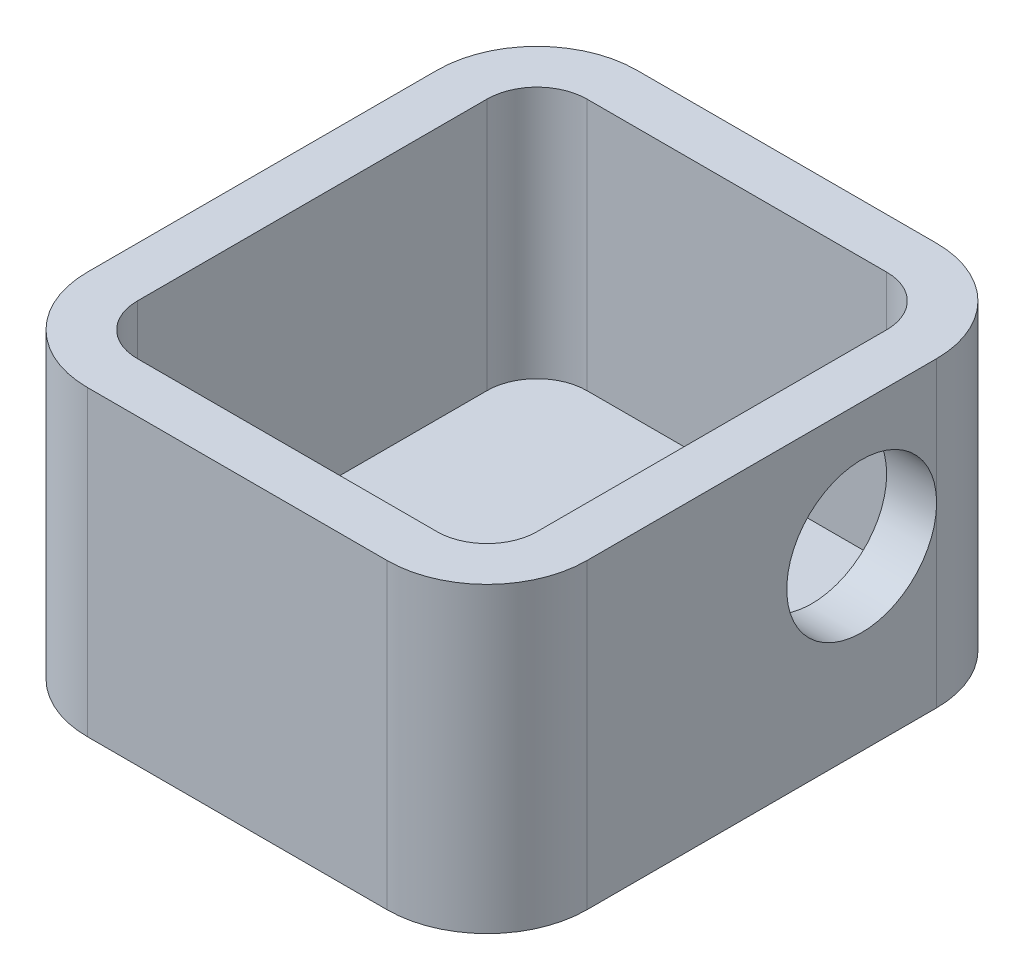
ISO-10303-21;
HEADER;
FILE_DESCRIPTION(('STEP AP214'),'2;1');
FILE_NAME('part.step','',(''),(''),'','','');
FILE_SCHEMA(('AUTOMOTIVE_DESIGN { 1 0 10303 214 1 1 1 1 }'));
ENDSEC;
DATA;
#1=APPLICATION_CONTEXT('core data for automotive mechanical design processes');
#2=APPLICATION_PROTOCOL_DEFINITION('international standard','automotive_design',2000,#1);
#3=PRODUCT_CONTEXT('',#1,'mechanical');
#4=PRODUCT('Part','Part','',(#3));
#5=PRODUCT_RELATED_PRODUCT_CATEGORY('part','',(#4));
#6=PRODUCT_DEFINITION_FORMATION('','',#4);
#7=PRODUCT_DEFINITION_CONTEXT('part definition',#1,'design');
#8=PRODUCT_DEFINITION('design','',#6,#7);
#9=PRODUCT_DEFINITION_SHAPE('','',#8);
#10=(LENGTH_UNIT() NAMED_UNIT(*) SI_UNIT(.MILLI.,.METRE.));
#11=(NAMED_UNIT(*) PLANE_ANGLE_UNIT() SI_UNIT($,.RADIAN.));
#12=(NAMED_UNIT(*) SI_UNIT($,.STERADIAN.) SOLID_ANGLE_UNIT());
#13=UNCERTAINTY_MEASURE_WITH_UNIT(LENGTH_MEASURE(1.E-05),#10,'distance_accuracy_value','');
#14=(GEOMETRIC_REPRESENTATION_CONTEXT(3) GLOBAL_UNCERTAINTY_ASSIGNED_CONTEXT((#13)) GLOBAL_UNIT_ASSIGNED_CONTEXT((#10,
#11,#12)) REPRESENTATION_CONTEXT('',''));
#15=CARTESIAN_POINT('',(0.,0.,0.));
#16=DIRECTION('',(0.,0.,1.));
#17=DIRECTION('',(1.,0.,0.));
#18=AXIS2_PLACEMENT_3D('',#15,#16,#17);
#19=CARTESIAN_POINT('',(-3.8307918132341,34.1865726109847,0.));
#20=DIRECTION('',(1.,0.,0.));
#21=DIRECTION('',(0.,0.,-1.));
#22=AXIS2_PLACEMENT_3D('',#19,#20,#21);
#23=PLANE('',#22);
#24=DIRECTION('',(0.,-1.,0.));
#25=VECTOR('',#24,1.);
#26=CARTESIAN_POINT('',(-3.8307918132341,34.1865726109847,-12.996740625783));
#27=LINE('',#26,#25);
#28=CARTESIAN_POINT('',(-3.8307918132341,-0.545564883652351,-12.996740625783));
#29=VERTEX_POINT('',#28);
#30=CARTESIAN_POINT('',(-3.8307918132341,-7.65556488365235,-12.996740625783));
#31=VERTEX_POINT('',#30);
#32=EDGE_CURVE('E270',#29,#31,#27,.T.);
#33=ORIENTED_EDGE('',*,*,#32,.F.);
#34=CARTESIAN_POINT('',(-3.8307918132341,-0.545564883652351,-9.99674062578299));
#35=DIRECTION('',(-1.,0.,0.));
#36=DIRECTION('',(0.,0.,1.));
#37=AXIS2_PLACEMENT_3D('',#34,#35,#36);
#38=CIRCLE('',#37,3.);
#39=EDGE_CURVE('E74',#29,#29,#38,.T.);
#40=ORIENTED_EDGE('',*,*,#39,.T.);
#41=CARTESIAN_POINT('',(-3.8307918132341,4.45443511634765,-12.996740625783));
#42=VERTEX_POINT('',#41);
#43=EDGE_CURVE('E266',#42,#29,#27,.T.);
#44=ORIENTED_EDGE('',*,*,#43,.F.);
#45=DIRECTION('',(0.,0.,-1.));
#46=VECTOR('',#45,1.);
#47=CARTESIAN_POINT('',(-3.8307918132341,4.45443511634765,0.));
#48=LINE('',#47,#46);
#49=CARTESIAN_POINT('',(-3.8307918132341,4.45443511634765,1.00325937421701));
#50=VERTEX_POINT('',#49);
#51=EDGE_CURVE('E278',#50,#42,#48,.T.);
#52=ORIENTED_EDGE('',*,*,#51,.F.);
#53=DIRECTION('',(0.,-1.,0.));
#54=VECTOR('',#53,1.);
#55=CARTESIAN_POINT('',(-3.8307918132341,34.1865726109847,1.00325937421701));
#56=LINE('',#55,#54);
#57=CARTESIAN_POINT('',(-3.8307918132341,-7.65556488365235,1.00325937421701));
#58=VERTEX_POINT('',#57);
#59=EDGE_CURVE('E225',#50,#58,#56,.T.);
#60=ORIENTED_EDGE('',*,*,#59,.T.);
#61=DIRECTION('',(0.,0.,1.));
#62=VECTOR('',#61,1.);
#63=CARTESIAN_POINT('',(-3.8307918132341,-7.65556488365235,-12.996740625783));
#64=LINE('',#63,#62);
#65=EDGE_CURVE('E216',#31,#58,#64,.T.);
#66=ORIENTED_EDGE('',*,*,#65,.F.);
#67=EDGE_LOOP('',(#33,#40,#44,#52,#60,#66));
#68=FACE_BOUND('',#67,.T.);
#69=ADVANCED_FACE('F60',(#68),#23,.T.);
#70=CARTESIAN_POINT('',(-5.8307918132341,34.1865726109847,0.));
#71=DIRECTION('',(1.,0.,0.));
#72=DIRECTION('',(0.,0.,-1.));
#73=AXIS2_PLACEMENT_3D('',#70,#71,#72);
#74=PLANE('',#73);
#75=DIRECTION('',(0.,-1.,0.));
#76=VECTOR('',#75,1.);
#77=CARTESIAN_POINT('',(-5.8307918132341,34.1865726109847,-12.996740625783));
#78=LINE('',#77,#76);
#79=CARTESIAN_POINT('',(-5.8307918132341,4.45443511634765,-12.996740625783));
#80=VERTEX_POINT('',#79);
#81=CARTESIAN_POINT('',(-5.8307918132341,-0.545564883652351,-12.996740625783));
#82=VERTEX_POINT('',#81);
#83=EDGE_CURVE('E240',#80,#82,#78,.T.);
#84=ORIENTED_EDGE('',*,*,#83,.T.);
#85=CARTESIAN_POINT('',(-5.8307918132341,-0.545564883652351,-9.99674062578299));
#86=DIRECTION('',(1.,0.,0.));
#87=DIRECTION('',(0.,0.,-1.));
#88=AXIS2_PLACEMENT_3D('',#85,#86,#87);
#89=CIRCLE('',#88,3.);
#90=EDGE_CURVE('E79',#82,#82,#89,.T.);
#91=ORIENTED_EDGE('',*,*,#90,.T.);
#92=CARTESIAN_POINT('',(-5.8307918132341,-5.65556488365235,-12.996740625783));
#93=VERTEX_POINT('',#92);
#94=EDGE_CURVE('E286',#82,#93,#78,.T.);
#95=ORIENTED_EDGE('',*,*,#94,.T.);
#96=DIRECTION('',(0.,0.,1.));
#97=VECTOR('',#96,1.);
#98=CARTESIAN_POINT('',(-5.8307918132341,-5.65556488365235,0.));
#99=LINE('',#98,#97);
#100=CARTESIAN_POINT('',(-5.8307918132341,-5.65556488365235,1.00325937421701));
#101=VERTEX_POINT('',#100);
#102=EDGE_CURVE('E236',#93,#101,#99,.T.);
#103=ORIENTED_EDGE('',*,*,#102,.T.);
#104=DIRECTION('',(0.,-1.,0.));
#105=VECTOR('',#104,1.);
#106=CARTESIAN_POINT('',(-5.8307918132341,34.1865726109847,1.00325937421701));
#107=LINE('',#106,#105);
#108=CARTESIAN_POINT('',(-5.8307918132341,4.45443511634765,1.00325937421701));
#109=VERTEX_POINT('',#108);
#110=EDGE_CURVE('E245',#109,#101,#107,.T.);
#111=ORIENTED_EDGE('',*,*,#110,.F.);
#112=DIRECTION('',(0.,0.,-1.));
#113=VECTOR('',#112,1.);
#114=CARTESIAN_POINT('',(-5.8307918132341,4.45443511634765,0.));
#115=LINE('',#114,#113);
#116=EDGE_CURVE('E234',#109,#80,#115,.T.);
#117=ORIENTED_EDGE('',*,*,#116,.T.);
#118=EDGE_LOOP('',(#84,#91,#95,#103,#111,#117));
#119=FACE_BOUND('',#118,.T.);
#120=ADVANCED_FACE('F367',(#119),#74,.F.);
#121=CARTESIAN_POINT('',(-7.8307918132341,34.1865726109847,-12.996740625783));
#122=DIRECTION('',(0.,-1.,0.));
#123=DIRECTION('',(0.,0.,-1.));
#124=AXIS2_PLACEMENT_3D('',#121,#122,#123);
#125=CYLINDRICAL_SURFACE('',#124,4.);
#126=CARTESIAN_POINT('',(-7.8307918132341,4.45443511634765,-12.996740625783));
#127=DIRECTION('',(0.,-1.,0.));
#128=DIRECTION('',(0.,0.,-1.));
#129=AXIS2_PLACEMENT_3D('',#126,#127,#128);
#130=CIRCLE('',#129,4.);
#131=CARTESIAN_POINT('',(-7.8307918132341,4.45443511634765,-16.996740625783));
#132=VERTEX_POINT('',#131);
#133=EDGE_CURVE('E314',#42,#132,#130,.F.);
#134=ORIENTED_EDGE('',*,*,#133,.F.);
#135=ORIENTED_EDGE('',*,*,#43,.T.);
#136=ORIENTED_EDGE('',*,*,#32,.T.);
#137=CARTESIAN_POINT('',(-7.8307918132341,-7.65556488365235,-12.996740625783));
#138=DIRECTION('',(0.,-1.,0.));
#139=DIRECTION('',(0.,0.,-1.));
#140=AXIS2_PLACEMENT_3D('',#137,#138,#139);
#141=CIRCLE('',#140,4.);
#142=CARTESIAN_POINT('',(-7.8307918132341,-7.65556488365235,-16.996740625783));
#143=VERTEX_POINT('',#142);
#144=EDGE_CURVE('E213',#143,#31,#141,.T.);
#145=ORIENTED_EDGE('',*,*,#144,.F.);
#146=DIRECTION('',(0.,-1.,0.));
#147=VECTOR('',#146,1.);
#148=CARTESIAN_POINT('',(-7.8307918132341,34.1865726109847,-16.996740625783));
#149=LINE('',#148,#147);
#150=EDGE_CURVE('E269',#132,#143,#149,.T.);
#151=ORIENTED_EDGE('',*,*,#150,.F.);
#152=EDGE_LOOP('',(#134,#135,#136,#145,#151));
#153=FACE_BOUND('',#152,.T.);
#154=ADVANCED_FACE('F344',(#153),#125,.T.);
#155=CARTESIAN_POINT('',(0.,34.1865726109847,-16.996740625783));
#156=DIRECTION('',(0.,0.,-1.));
#157=DIRECTION('',(-1.,0.,0.));
#158=AXIS2_PLACEMENT_3D('',#155,#156,#157);
#159=PLANE('',#158);
#160=DIRECTION('',(-1.,0.,0.));
#161=VECTOR('',#160,1.);
#162=CARTESIAN_POINT('',(0.,4.45443511634765,-16.996740625783));
#163=LINE('',#162,#161);
#164=CARTESIAN_POINT('',(-19.8307918132341,4.45443511634765,-16.996740625783));
#165=VERTEX_POINT('',#164);
#166=EDGE_CURVE('E316',#132,#165,#163,.T.);
#167=ORIENTED_EDGE('',*,*,#166,.F.);
#168=ORIENTED_EDGE('',*,*,#150,.T.);
#169=DIRECTION('',(1.,0.,0.));
#170=VECTOR('',#169,1.);
#171=CARTESIAN_POINT('',(-19.8307918132341,-7.65556488365235,-16.996740625783));
#172=LINE('',#171,#170);
#173=CARTESIAN_POINT('',(-19.8307918132341,-7.65556488365235,-16.996740625783));
#174=VERTEX_POINT('',#173);
#175=EDGE_CURVE('E197',#174,#143,#172,.T.);
#176=ORIENTED_EDGE('',*,*,#175,.F.);
#177=DIRECTION('',(0.,-1.,0.));
#178=VECTOR('',#177,1.);
#179=CARTESIAN_POINT('',(-19.8307918132341,34.1865726109847,-16.996740625783));
#180=LINE('',#179,#178);
#181=EDGE_CURVE('E188',#165,#174,#180,.T.);
#182=ORIENTED_EDGE('',*,*,#181,.F.);
#183=EDGE_LOOP('',(#167,#168,#176,#182));
#184=FACE_BOUND('',#183,.T.);
#185=ADVANCED_FACE('F375',(#184),#159,.T.);
#186=CARTESIAN_POINT('',(-19.8307918132341,34.1865726109847,-12.996740625783));
#187=DIRECTION('',(0.,-1.,0.));
#188=DIRECTION('',(0.,0.,-1.));
#189=AXIS2_PLACEMENT_3D('',#186,#187,#188);
#190=CYLINDRICAL_SURFACE('',#189,4.);
#191=CARTESIAN_POINT('',(-19.8307918132341,4.45443511634765,-12.996740625783));
#192=DIRECTION('',(0.,-1.,0.));
#193=DIRECTION('',(0.,0.,-1.));
#194=AXIS2_PLACEMENT_3D('',#191,#192,#193);
#195=CIRCLE('',#194,4.);
#196=CARTESIAN_POINT('',(-23.8307918132341,4.45443511634765,-12.996740625783));
#197=VERTEX_POINT('',#196);
#198=EDGE_CURVE('E318',#165,#197,#195,.F.);
#199=ORIENTED_EDGE('',*,*,#198,.F.);
#200=ORIENTED_EDGE('',*,*,#181,.T.);
#201=CARTESIAN_POINT('',(-19.8307918132341,-7.65556488365235,-12.996740625783));
#202=DIRECTION('',(0.,-1.,0.));
#203=DIRECTION('',(0.,0.,-1.));
#204=AXIS2_PLACEMENT_3D('',#201,#202,#203);
#205=CIRCLE('',#204,4.);
#206=CARTESIAN_POINT('',(-23.8307918132341,-7.65556488365235,-12.996740625783));
#207=VERTEX_POINT('',#206);
#208=EDGE_CURVE('E191',#207,#174,#205,.T.);
#209=ORIENTED_EDGE('',*,*,#208,.F.);
#210=DIRECTION('',(0.,-1.,0.));
#211=VECTOR('',#210,1.);
#212=CARTESIAN_POINT('',(-23.8307918132341,34.1865726109847,-12.996740625783));
#213=LINE('',#212,#211);
#214=EDGE_CURVE('E178',#197,#207,#213,.T.);
#215=ORIENTED_EDGE('',*,*,#214,.F.);
#216=EDGE_LOOP('',(#199,#200,#209,#215));
#217=FACE_BOUND('',#216,.T.);
#218=ADVANCED_FACE('F192',(#217),#190,.T.);
#219=CARTESIAN_POINT('',(-23.8307918132341,34.1865726109847,0.));
#220=DIRECTION('',(-1.,0.,0.));
#221=DIRECTION('',(0.,0.,1.));
#222=AXIS2_PLACEMENT_3D('',#219,#220,#221);
#223=PLANE('',#222);
#224=DIRECTION('',(0.,0.,1.));
#225=VECTOR('',#224,1.);
#226=CARTESIAN_POINT('',(-23.8307918132341,4.45443511634765,0.));
#227=LINE('',#226,#225);
#228=CARTESIAN_POINT('',(-23.8307918132341,4.45443511634765,1.00325937421701));
#229=VERTEX_POINT('',#228);
#230=EDGE_CURVE('E184',#197,#229,#227,.T.);
#231=ORIENTED_EDGE('',*,*,#230,.F.);
#232=ORIENTED_EDGE('',*,*,#214,.T.);
#233=DIRECTION('',(0.,0.,-1.));
#234=VECTOR('',#233,1.);
#235=CARTESIAN_POINT('',(-23.8307918132341,-7.65556488365235,1.00325937421701));
#236=LINE('',#235,#234);
#237=CARTESIAN_POINT('',(-23.8307918132341,-7.65556488365235,1.00325937421701));
#238=VERTEX_POINT('',#237);
#239=EDGE_CURVE('E183',#238,#207,#236,.T.);
#240=ORIENTED_EDGE('',*,*,#239,.F.);
#241=DIRECTION('',(0.,-1.,0.));
#242=VECTOR('',#241,1.);
#243=CARTESIAN_POINT('',(-23.8307918132341,34.1865726109847,1.00325937421701));
#244=LINE('',#243,#242);
#245=EDGE_CURVE('E187',#229,#238,#244,.T.);
#246=ORIENTED_EDGE('',*,*,#245,.F.);
#247=EDGE_LOOP('',(#231,#232,#240,#246));
#248=FACE_BOUND('',#247,.T.);
#249=ADVANCED_FACE('F180',(#248),#223,.T.);
#250=CARTESIAN_POINT('',(-19.8307918132341,34.1865726109847,1.00325937421701));
#251=DIRECTION('',(0.,-1.,0.));
#252=DIRECTION('',(0.,0.,-1.));
#253=AXIS2_PLACEMENT_3D('',#250,#251,#252);
#254=CYLINDRICAL_SURFACE('',#253,4.);
#255=CARTESIAN_POINT('',(-19.8307918132341,4.45443511634765,1.00325937421701));
#256=DIRECTION('',(0.,-1.,0.));
#257=DIRECTION('',(0.,0.,-1.));
#258=AXIS2_PLACEMENT_3D('',#255,#256,#257);
#259=CIRCLE('',#258,4.);
#260=CARTESIAN_POINT('',(-19.8307918132341,4.45443511634765,5.00325937421701));
#261=VERTEX_POINT('',#260);
#262=EDGE_CURVE('E320',#229,#261,#259,.F.);
#263=ORIENTED_EDGE('',*,*,#262,.F.);
#264=ORIENTED_EDGE('',*,*,#245,.T.);
#265=CARTESIAN_POINT('',(-19.8307918132341,-7.65556488365235,1.00325937421701));
#266=DIRECTION('',(0.,-1.,0.));
#267=DIRECTION('',(0.,0.,-1.));
#268=AXIS2_PLACEMENT_3D('',#265,#266,#267);
#269=CIRCLE('',#268,4.);
#270=CARTESIAN_POINT('',(-19.8307918132341,-7.65556488365235,5.00325937421701));
#271=VERTEX_POINT('',#270);
#272=EDGE_CURVE('E204',#271,#238,#269,.T.);
#273=ORIENTED_EDGE('',*,*,#272,.F.);
#274=DIRECTION('',(0.,-1.,0.));
#275=VECTOR('',#274,1.);
#276=CARTESIAN_POINT('',(-19.8307918132341,34.1865726109847,5.00325937421701));
#277=LINE('',#276,#275);
#278=EDGE_CURVE('E274',#261,#271,#277,.T.);
#279=ORIENTED_EDGE('',*,*,#278,.F.);
#280=EDGE_LOOP('',(#263,#264,#273,#279));
#281=FACE_BOUND('',#280,.T.);
#282=ADVANCED_FACE('F383',(#281),#254,.T.);
#283=CARTESIAN_POINT('',(0.,34.1865726109847,5.00325937421702));
#284=DIRECTION('',(0.,0.,1.));
#285=DIRECTION('',(1.,0.,0.));
#286=AXIS2_PLACEMENT_3D('',#283,#284,#285);
#287=PLANE('',#286);
#288=DIRECTION('',(1.,0.,0.));
#289=VECTOR('',#288,1.);
#290=CARTESIAN_POINT('',(0.,4.45443511634765,5.00325937421702));
#291=LINE('',#290,#289);
#292=CARTESIAN_POINT('',(-7.8307918132341,4.45443511634765,5.00325937421701));
#293=VERTEX_POINT('',#292);
#294=EDGE_CURVE('E64',#261,#293,#291,.T.);
#295=ORIENTED_EDGE('',*,*,#294,.F.);
#296=ORIENTED_EDGE('',*,*,#278,.T.);
#297=DIRECTION('',(-1.,0.,0.));
#298=VECTOR('',#297,1.);
#299=CARTESIAN_POINT('',(-7.8307918132341,-7.65556488365235,5.00325937421701));
#300=LINE('',#299,#298);
#301=CARTESIAN_POINT('',(-7.8307918132341,-7.65556488365235,5.00325937421701));
#302=VERTEX_POINT('',#301);
#303=EDGE_CURVE('E222',#302,#271,#300,.T.);
#304=ORIENTED_EDGE('',*,*,#303,.F.);
#305=DIRECTION('',(0.,-1.,0.));
#306=VECTOR('',#305,1.);
#307=CARTESIAN_POINT('',(-7.8307918132341,34.1865726109847,5.00325937421701));
#308=LINE('',#307,#306);
#309=EDGE_CURVE('E259',#293,#302,#308,.T.);
#310=ORIENTED_EDGE('',*,*,#309,.F.);
#311=EDGE_LOOP('',(#295,#296,#304,#310));
#312=FACE_BOUND('',#311,.T.);
#313=ADVANCED_FACE('F331',(#312),#287,.T.);
#314=CARTESIAN_POINT('',(-19.8307918132341,34.1865726109847,-12.996740625783));
#315=DIRECTION('',(0.,-1.,0.));
#316=DIRECTION('',(0.,0.,-1.));
#317=AXIS2_PLACEMENT_3D('',#314,#315,#316);
#318=CYLINDRICAL_SURFACE('',#317,2.);
#319=DIRECTION('',(0.,-1.,0.));
#320=VECTOR('',#319,1.);
#321=CARTESIAN_POINT('',(-19.8307918132341,34.1865726109847,-14.996740625783));
#322=LINE('',#321,#320);
#323=CARTESIAN_POINT('',(-19.8307918132341,4.45443511634765,-14.996740625783));
#324=VERTEX_POINT('',#323);
#325=CARTESIAN_POINT('',(-19.8307918132341,-5.65556488365235,-14.996740625783));
#326=VERTEX_POINT('',#325);
#327=EDGE_CURVE('E230',#324,#326,#322,.T.);
#328=ORIENTED_EDGE('',*,*,#327,.F.);
#329=CARTESIAN_POINT('',(-19.8307918132341,4.45443511634765,-12.996740625783));
#330=DIRECTION('',(0.,-1.,0.));
#331=DIRECTION('',(0.,0.,-1.));
#332=AXIS2_PLACEMENT_3D('',#329,#330,#331);
#333=CIRCLE('',#332,2.);
#334=CARTESIAN_POINT('',(-21.8307918132341,4.45443511634765,-12.996740625783));
#335=VERTEX_POINT('',#334);
#336=EDGE_CURVE('E276',#324,#335,#333,.F.);
#337=ORIENTED_EDGE('',*,*,#336,.T.);
#338=DIRECTION('',(0.,-1.,0.));
#339=VECTOR('',#338,1.);
#340=CARTESIAN_POINT('',(-21.8307918132341,34.1865726109847,-12.996740625783));
#341=LINE('',#340,#339);
#342=CARTESIAN_POINT('',(-21.8307918132341,-5.65556488365235,-12.996740625783));
#343=VERTEX_POINT('',#342);
#344=EDGE_CURVE('E264',#335,#343,#341,.T.);
#345=ORIENTED_EDGE('',*,*,#344,.T.);
#346=CARTESIAN_POINT('',(-19.8307918132341,-5.65556488365235,-12.996740625783));
#347=DIRECTION('',(0.,-1.,0.));
#348=DIRECTION('',(0.,0.,-1.));
#349=AXIS2_PLACEMENT_3D('',#346,#347,#348);
#350=CIRCLE('',#349,2.);
#351=EDGE_CURVE('E261',#343,#326,#350,.T.);
#352=ORIENTED_EDGE('',*,*,#351,.T.);
#353=EDGE_LOOP('',(#328,#337,#345,#352));
#354=FACE_BOUND('',#353,.T.);
#355=ADVANCED_FACE('F389',(#354),#318,.F.);
#356=CARTESIAN_POINT('',(0.,34.1865726109847,-14.996740625783));
#357=DIRECTION('',(0.,0.,-1.));
#358=DIRECTION('',(-1.,0.,0.));
#359=AXIS2_PLACEMENT_3D('',#356,#357,#358);
#360=PLANE('',#359);
#361=DIRECTION('',(0.,-1.,0.));
#362=VECTOR('',#361,1.);
#363=CARTESIAN_POINT('',(-7.8307918132341,34.1865726109847,-14.996740625783));
#364=LINE('',#363,#362);
#365=CARTESIAN_POINT('',(-7.8307918132341,4.45443511634765,-14.996740625783));
#366=VERTEX_POINT('',#365);
#367=CARTESIAN_POINT('',(-7.8307918132341,-5.65556488365235,-14.996740625783));
#368=VERTEX_POINT('',#367);
#369=EDGE_CURVE('E235',#366,#368,#364,.T.);
#370=ORIENTED_EDGE('',*,*,#369,.F.);
#371=DIRECTION('',(-1.,0.,0.));
#372=VECTOR('',#371,1.);
#373=CARTESIAN_POINT('',(0.,4.45443511634765,-14.996740625783));
#374=LINE('',#373,#372);
#375=EDGE_CURVE('E263',#366,#324,#374,.T.);
#376=ORIENTED_EDGE('',*,*,#375,.T.);
#377=ORIENTED_EDGE('',*,*,#327,.T.);
#378=DIRECTION('',(1.,0.,0.));
#379=VECTOR('',#378,1.);
#380=CARTESIAN_POINT('',(0.,-5.65556488365235,-14.996740625783));
#381=LINE('',#380,#379);
#382=EDGE_CURVE('E226',#326,#368,#381,.T.);
#383=ORIENTED_EDGE('',*,*,#382,.T.);
#384=EDGE_LOOP('',(#370,#376,#377,#383));
#385=FACE_BOUND('',#384,.T.);
#386=ADVANCED_FACE('F395',(#385),#360,.F.);
#387=CARTESIAN_POINT('',(-7.8307918132341,34.1865726109847,-12.996740625783));
#388=DIRECTION('',(0.,-1.,0.));
#389=DIRECTION('',(0.,0.,-1.));
#390=AXIS2_PLACEMENT_3D('',#387,#388,#389);
#391=CYLINDRICAL_SURFACE('',#390,2.);
#392=ORIENTED_EDGE('',*,*,#83,.F.);
#393=CARTESIAN_POINT('',(-7.8307918132341,4.45443511634765,-12.996740625783));
#394=DIRECTION('',(0.,-1.,0.));
#395=DIRECTION('',(0.,0.,-1.));
#396=AXIS2_PLACEMENT_3D('',#393,#394,#395);
#397=CIRCLE('',#396,2.);
#398=EDGE_CURVE('E229',#80,#366,#397,.F.);
#399=ORIENTED_EDGE('',*,*,#398,.T.);
#400=ORIENTED_EDGE('',*,*,#369,.T.);
#401=CARTESIAN_POINT('',(-7.8307918132341,-5.65556488365235,-12.996740625783));
#402=DIRECTION('',(0.,-1.,0.));
#403=DIRECTION('',(0.,0.,-1.));
#404=AXIS2_PLACEMENT_3D('',#401,#402,#403);
#405=CIRCLE('',#404,2.);
#406=EDGE_CURVE('E231',#368,#93,#405,.T.);
#407=ORIENTED_EDGE('',*,*,#406,.T.);
#408=ORIENTED_EDGE('',*,*,#94,.F.);
#409=EDGE_LOOP('',(#392,#399,#400,#407,#408));
#410=FACE_BOUND('',#409,.T.);
#411=ADVANCED_FACE('F399',(#410),#391,.F.);
#412=CARTESIAN_POINT('',(-7.8307918132341,34.1865726109847,1.00325937421701));
#413=DIRECTION('',(0.,-1.,0.));
#414=DIRECTION('',(0.,0.,-1.));
#415=AXIS2_PLACEMENT_3D('',#412,#413,#414);
#416=CYLINDRICAL_SURFACE('',#415,2.);
#417=DIRECTION('',(0.,-1.,0.));
#418=VECTOR('',#417,1.);
#419=CARTESIAN_POINT('',(-7.8307918132341,34.1865726109847,3.00325937421701));
#420=LINE('',#419,#418);
#421=CARTESIAN_POINT('',(-7.8307918132341,4.45443511634765,3.00325937421701));
#422=VERTEX_POINT('',#421);
#423=CARTESIAN_POINT('',(-7.8307918132341,-5.65556488365235,3.00325937421701));
#424=VERTEX_POINT('',#423);
#425=EDGE_CURVE('E250',#422,#424,#420,.T.);
#426=ORIENTED_EDGE('',*,*,#425,.F.);
#427=CARTESIAN_POINT('',(-7.8307918132341,4.45443511634765,1.00325937421701));
#428=DIRECTION('',(0.,-1.,0.));
#429=DIRECTION('',(0.,0.,-1.));
#430=AXIS2_PLACEMENT_3D('',#427,#428,#429);
#431=CIRCLE('',#430,2.);
#432=EDGE_CURVE('E239',#422,#109,#431,.F.);
#433=ORIENTED_EDGE('',*,*,#432,.T.);
#434=ORIENTED_EDGE('',*,*,#110,.T.);
#435=CARTESIAN_POINT('',(-7.8307918132341,-5.65556488365235,1.00325937421701));
#436=DIRECTION('',(0.,-1.,0.));
#437=DIRECTION('',(0.,0.,-1.));
#438=AXIS2_PLACEMENT_3D('',#435,#436,#437);
#439=CIRCLE('',#438,2.);
#440=EDGE_CURVE('E241',#101,#424,#439,.T.);
#441=ORIENTED_EDGE('',*,*,#440,.T.);
#442=EDGE_LOOP('',(#426,#433,#434,#441));
#443=FACE_BOUND('',#442,.T.);
#444=ADVANCED_FACE('F402',(#443),#416,.F.);
#445=CARTESIAN_POINT('',(0.,34.1865726109847,3.00325937421702));
#446=DIRECTION('',(0.,0.,1.));
#447=DIRECTION('',(1.,0.,0.));
#448=AXIS2_PLACEMENT_3D('',#445,#446,#447);
#449=PLANE('',#448);
#450=DIRECTION('',(0.,-1.,0.));
#451=VECTOR('',#450,1.);
#452=CARTESIAN_POINT('',(-19.8307918132341,34.1865726109847,3.00325937421701));
#453=LINE('',#452,#451);
#454=CARTESIAN_POINT('',(-19.8307918132341,4.45443511634765,3.00325937421701));
#455=VERTEX_POINT('',#454);
#456=CARTESIAN_POINT('',(-19.8307918132341,-5.65556488365235,3.00325937421701));
#457=VERTEX_POINT('',#456);
#458=EDGE_CURVE('E255',#455,#457,#453,.T.);
#459=ORIENTED_EDGE('',*,*,#458,.F.);
#460=DIRECTION('',(1.,0.,0.));
#461=VECTOR('',#460,1.);
#462=CARTESIAN_POINT('',(0.,4.45443511634765,3.00325937421702));
#463=LINE('',#462,#461);
#464=EDGE_CURVE('E244',#455,#422,#463,.T.);
#465=ORIENTED_EDGE('',*,*,#464,.T.);
#466=ORIENTED_EDGE('',*,*,#425,.T.);
#467=DIRECTION('',(-1.,0.,0.));
#468=VECTOR('',#467,1.);
#469=CARTESIAN_POINT('',(0.,-5.65556488365235,3.00325937421702));
#470=LINE('',#469,#468);
#471=EDGE_CURVE('E246',#424,#457,#470,.T.);
#472=ORIENTED_EDGE('',*,*,#471,.T.);
#473=EDGE_LOOP('',(#459,#465,#466,#472));
#474=FACE_BOUND('',#473,.T.);
#475=ADVANCED_FACE('F407',(#474),#449,.F.);
#476=CARTESIAN_POINT('',(-19.8307918132341,34.1865726109847,1.00325937421701));
#477=DIRECTION('',(0.,-1.,0.));
#478=DIRECTION('',(0.,0.,-1.));
#479=AXIS2_PLACEMENT_3D('',#476,#477,#478);
#480=CYLINDRICAL_SURFACE('',#479,2.);
#481=DIRECTION('',(0.,-1.,0.));
#482=VECTOR('',#481,1.);
#483=CARTESIAN_POINT('',(-21.8307918132341,34.1865726109847,1.00325937421701));
#484=LINE('',#483,#482);
#485=CARTESIAN_POINT('',(-21.8307918132341,4.45443511634765,1.00325937421701));
#486=VERTEX_POINT('',#485);
#487=CARTESIAN_POINT('',(-21.8307918132341,-5.65556488365235,1.00325937421701));
#488=VERTEX_POINT('',#487);
#489=EDGE_CURVE('E260',#486,#488,#484,.T.);
#490=ORIENTED_EDGE('',*,*,#489,.F.);
#491=CARTESIAN_POINT('',(-19.8307918132341,4.45443511634765,1.00325937421701));
#492=DIRECTION('',(0.,-1.,0.));
#493=DIRECTION('',(0.,0.,-1.));
#494=AXIS2_PLACEMENT_3D('',#491,#492,#493);
#495=CIRCLE('',#494,2.);
#496=EDGE_CURVE('E249',#486,#455,#495,.F.);
#497=ORIENTED_EDGE('',*,*,#496,.T.);
#498=ORIENTED_EDGE('',*,*,#458,.T.);
#499=CARTESIAN_POINT('',(-19.8307918132341,-5.65556488365235,1.00325937421701));
#500=DIRECTION('',(0.,-1.,0.));
#501=DIRECTION('',(0.,0.,-1.));
#502=AXIS2_PLACEMENT_3D('',#499,#500,#501);
#503=CIRCLE('',#502,2.);
#504=EDGE_CURVE('E251',#457,#488,#503,.T.);
#505=ORIENTED_EDGE('',*,*,#504,.T.);
#506=EDGE_LOOP('',(#490,#497,#498,#505));
#507=FACE_BOUND('',#506,.T.);
#508=ADVANCED_FACE('F411',(#507),#480,.F.);
#509=CARTESIAN_POINT('',(-21.8307918132341,34.1865726109847,0.));
#510=DIRECTION('',(-1.,0.,0.));
#511=DIRECTION('',(0.,0.,1.));
#512=AXIS2_PLACEMENT_3D('',#509,#510,#511);
#513=PLANE('',#512);
#514=ORIENTED_EDGE('',*,*,#344,.F.);
#515=DIRECTION('',(0.,0.,1.));
#516=VECTOR('',#515,1.);
#517=CARTESIAN_POINT('',(-21.8307918132341,4.45443511634765,0.));
#518=LINE('',#517,#516);
#519=EDGE_CURVE('E254',#335,#486,#518,.T.);
#520=ORIENTED_EDGE('',*,*,#519,.T.);
#521=ORIENTED_EDGE('',*,*,#489,.T.);
#522=DIRECTION('',(0.,0.,-1.));
#523=VECTOR('',#522,1.);
#524=CARTESIAN_POINT('',(-21.8307918132341,-5.65556488365235,0.));
#525=LINE('',#524,#523);
#526=EDGE_CURVE('E256',#488,#343,#525,.T.);
#527=ORIENTED_EDGE('',*,*,#526,.T.);
#528=EDGE_LOOP('',(#514,#520,#521,#527));
#529=FACE_BOUND('',#528,.T.);
#530=ADVANCED_FACE('F392',(#529),#513,.F.);
#531=CARTESIAN_POINT('',(-7.8307918132341,34.1865726109847,1.00325937421701));
#532=DIRECTION('',(0.,-1.,0.));
#533=DIRECTION('',(0.,0.,-1.));
#534=AXIS2_PLACEMENT_3D('',#531,#532,#533);
#535=CYLINDRICAL_SURFACE('',#534,4.);
#536=CARTESIAN_POINT('',(-7.8307918132341,4.45443511634765,1.00325937421701));
#537=DIRECTION('',(0.,-1.,0.));
#538=DIRECTION('',(0.,0.,-1.));
#539=AXIS2_PLACEMENT_3D('',#536,#537,#538);
#540=CIRCLE('',#539,4.);
#541=EDGE_CURVE('E12',#293,#50,#540,.F.);
#542=ORIENTED_EDGE('',*,*,#541,.F.);
#543=ORIENTED_EDGE('',*,*,#309,.T.);
#544=CARTESIAN_POINT('',(-7.8307918132341,-7.65556488365235,1.00325937421701));
#545=DIRECTION('',(0.,-1.,0.));
#546=DIRECTION('',(0.,0.,-1.));
#547=AXIS2_PLACEMENT_3D('',#544,#545,#546);
#548=CIRCLE('',#547,4.);
#549=EDGE_CURVE('E219',#58,#302,#548,.T.);
#550=ORIENTED_EDGE('',*,*,#549,.F.);
#551=ORIENTED_EDGE('',*,*,#59,.F.);
#552=EDGE_LOOP('',(#542,#543,#550,#551));
#553=FACE_BOUND('',#552,.T.);
#554=ADVANCED_FACE('F335',(#553),#535,.T.);
#555=CARTESIAN_POINT('',(-19.8307918132341,4.45443511634765,-12.996740625783));
#556=DIRECTION('',(0.,-1.,0.));
#557=DIRECTION('',(0.,0.,-1.));
#558=AXIS2_PLACEMENT_3D('',#555,#556,#557);
#559=PLANE('',#558);
#560=ORIENTED_EDGE('',*,*,#51,.T.);
#561=ORIENTED_EDGE('',*,*,#133,.T.);
#562=ORIENTED_EDGE('',*,*,#166,.T.);
#563=ORIENTED_EDGE('',*,*,#198,.T.);
#564=ORIENTED_EDGE('',*,*,#230,.T.);
#565=ORIENTED_EDGE('',*,*,#262,.T.);
#566=ORIENTED_EDGE('',*,*,#294,.T.);
#567=ORIENTED_EDGE('',*,*,#541,.T.);
#568=EDGE_LOOP('',(#560,#561,#562,#563,#564,#565,#566,#567));
#569=FACE_BOUND('',#568,.T.);
#570=ORIENTED_EDGE('',*,*,#375,.F.);
#571=ORIENTED_EDGE('',*,*,#398,.F.);
#572=ORIENTED_EDGE('',*,*,#116,.F.);
#573=ORIENTED_EDGE('',*,*,#432,.F.);
#574=ORIENTED_EDGE('',*,*,#464,.F.);
#575=ORIENTED_EDGE('',*,*,#496,.F.);
#576=ORIENTED_EDGE('',*,*,#519,.F.);
#577=ORIENTED_EDGE('',*,*,#336,.F.);
#578=EDGE_LOOP('',(#570,#571,#572,#573,#574,#575,#576,#577));
#579=FACE_BOUND('',#578,.T.);
#580=ADVANCED_FACE('F62',(#569,#579),#559,.F.);
#581=CARTESIAN_POINT('',(-19.8307918132341,-5.65556488365235,-12.996740625783));
#582=DIRECTION('',(0.,-1.,0.));
#583=DIRECTION('',(0.,0.,-1.));
#584=AXIS2_PLACEMENT_3D('',#581,#582,#583);
#585=PLANE('',#584);
#586=CARTESIAN_POINT('',(-13.8307918132341,-5.65556488365235,-1.99674062578299));
#587=DIRECTION('',(0.,-1.,0.));
#588=DIRECTION('',(0.,0.,-1.));
#589=AXIS2_PLACEMENT_3D('',#586,#587,#588);
#590=CIRCLE('',#589,4.);
#591=CARTESIAN_POINT('',(-13.8307918132341,-5.65556488365235,-5.99674062578299));
#592=VERTEX_POINT('',#591);
#593=EDGE_CURVE('E208',#592,#592,#590,.T.);
#594=ORIENTED_EDGE('',*,*,#593,.T.);
#595=EDGE_LOOP('',(#594));
#596=FACE_BOUND('',#595,.T.);
#597=ORIENTED_EDGE('',*,*,#382,.F.);
#598=ORIENTED_EDGE('',*,*,#351,.F.);
#599=ORIENTED_EDGE('',*,*,#526,.F.);
#600=ORIENTED_EDGE('',*,*,#504,.F.);
#601=ORIENTED_EDGE('',*,*,#471,.F.);
#602=ORIENTED_EDGE('',*,*,#440,.F.);
#603=ORIENTED_EDGE('',*,*,#102,.F.);
#604=ORIENTED_EDGE('',*,*,#406,.F.);
#605=EDGE_LOOP('',(#597,#598,#599,#600,#601,#602,#603,#604));
#606=FACE_BOUND('',#605,.T.);
#607=ADVANCED_FACE('F352',(#596,#606),#585,.F.);
#608=CARTESIAN_POINT('',(-19.8307918132341,-7.65556488365235,-12.996740625783));
#609=DIRECTION('',(0.,-1.,0.));
#610=DIRECTION('',(0.,0.,-1.));
#611=AXIS2_PLACEMENT_3D('',#608,#609,#610);
#612=PLANE('',#611);
#613=ORIENTED_EDGE('',*,*,#239,.T.);
#614=ORIENTED_EDGE('',*,*,#208,.T.);
#615=ORIENTED_EDGE('',*,*,#175,.T.);
#616=ORIENTED_EDGE('',*,*,#144,.T.);
#617=ORIENTED_EDGE('',*,*,#65,.T.);
#618=ORIENTED_EDGE('',*,*,#549,.T.);
#619=ORIENTED_EDGE('',*,*,#303,.T.);
#620=ORIENTED_EDGE('',*,*,#272,.T.);
#621=EDGE_LOOP('',(#613,#614,#615,#616,#617,#618,#619,#620));
#622=FACE_BOUND('',#621,.T.);
#623=CARTESIAN_POINT('',(-13.8307918132341,-7.65556488365235,-1.99674062578299));
#624=DIRECTION('',(0.,-1.,0.));
#625=DIRECTION('',(0.,0.,-1.));
#626=AXIS2_PLACEMENT_3D('',#623,#624,#625);
#627=CIRCLE('',#626,4.);
#628=CARTESIAN_POINT('',(-13.8307918132341,-7.65556488365235,-5.99674062578299));
#629=VERTEX_POINT('',#628);
#630=EDGE_CURVE('E205',#629,#629,#627,.T.);
#631=ORIENTED_EDGE('',*,*,#630,.F.);
#632=EDGE_LOOP('',(#631));
#633=FACE_BOUND('',#632,.T.);
#634=ADVANCED_FACE('F200',(#622,#633),#612,.T.);
#635=CARTESIAN_POINT('',(-13.8307918132341,-7.65556488365235,-1.99674062578299));
#636=DIRECTION('',(0.,1.,0.));
#637=DIRECTION('',(0.,0.,1.));
#638=AXIS2_PLACEMENT_3D('',#635,#636,#637);
#639=CYLINDRICAL_SURFACE('',#638,4.);
#640=ORIENTED_EDGE('',*,*,#630,.T.);
#641=EDGE_LOOP('',(#640));
#642=FACE_BOUND('',#641,.T.);
#643=ORIENTED_EDGE('',*,*,#593,.F.);
#644=EDGE_LOOP('',(#643));
#645=FACE_BOUND('',#644,.T.);
#646=ADVANCED_FACE('F355',(#642,#645),#639,.F.);
#647=CARTESIAN_POINT('',(-23.8317918132341,-0.545564883652351,-9.99674062578298));
#648=DIRECTION('',(1.,0.,0.));
#649=DIRECTION('',(0.,0.,-1.));
#650=AXIS2_PLACEMENT_3D('',#647,#648,#649);
#651=CYLINDRICAL_SURFACE('',#650,3.);
#652=ORIENTED_EDGE('',*,*,#39,.F.);
#653=EDGE_LOOP('',(#652));
#654=FACE_BOUND('',#653,.T.);
#655=ORIENTED_EDGE('',*,*,#90,.F.);
#656=EDGE_LOOP('',(#655));
#657=FACE_BOUND('',#656,.T.);
#658=ADVANCED_FACE('F357',(#654,#657),#651,.F.);
#659=CLOSED_SHELL('',(#69,#120,#154,#185,#218,#249,#282,#313,#355,#386,#411,#444,#475,#508,#530,
#554,#580,#607,#634,#646,#658));
#660=MANIFOLD_SOLID_BREP('B2',#659);
#661=ADVANCED_BREP_SHAPE_REPRESENTATION('',(#18,#660),#14);
#662=SHAPE_DEFINITION_REPRESENTATION(#9,#661);
ENDSEC;
END-ISO-10303-21;
